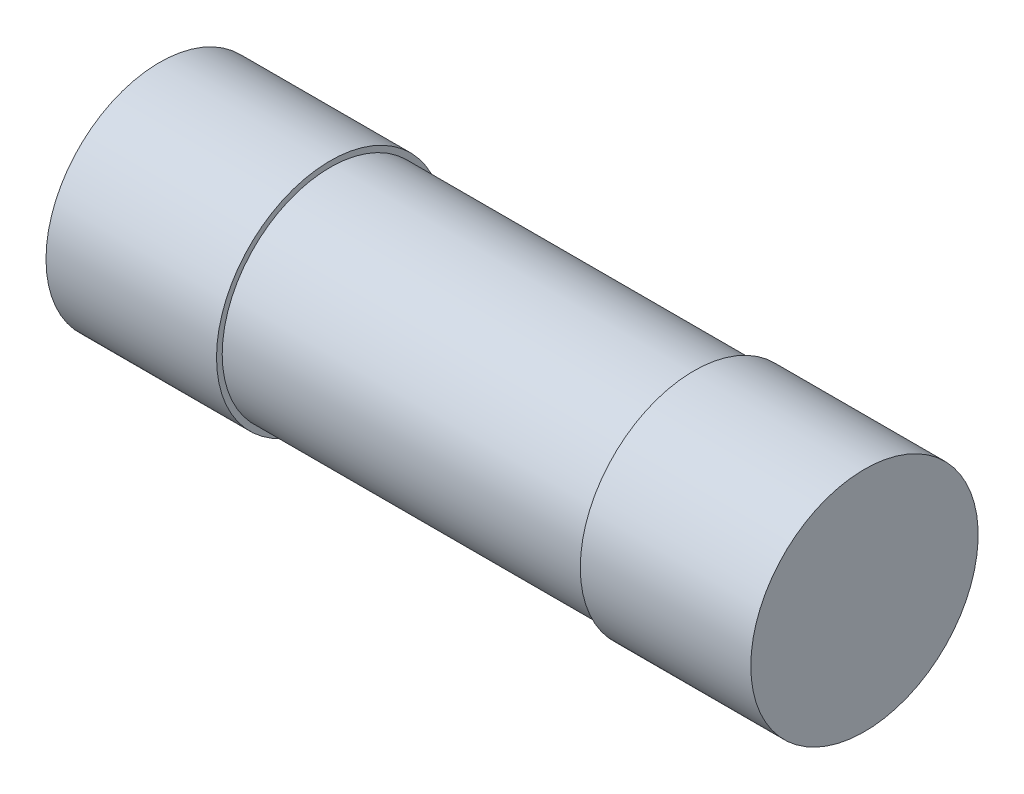
ISO-10303-21;
HEADER;
FILE_DESCRIPTION(('STEP AP214'),'2;1');
FILE_NAME('part.step','',(''),(''),'','','');
FILE_SCHEMA(('AUTOMOTIVE_DESIGN { 1 0 10303 214 1 1 1 1 }'));
ENDSEC;
DATA;
#1=APPLICATION_CONTEXT('core data for automotive mechanical design processes');
#2=APPLICATION_PROTOCOL_DEFINITION('international standard','automotive_design',2000,#1);
#3=PRODUCT_CONTEXT('',#1,'mechanical');
#4=PRODUCT('Part','Part','',(#3));
#5=PRODUCT_RELATED_PRODUCT_CATEGORY('part','',(#4));
#6=PRODUCT_DEFINITION_FORMATION('','',#4);
#7=PRODUCT_DEFINITION_CONTEXT('part definition',#1,'design');
#8=PRODUCT_DEFINITION('design','',#6,#7);
#9=PRODUCT_DEFINITION_SHAPE('','',#8);
#10=(LENGTH_UNIT() NAMED_UNIT(*) SI_UNIT(.MILLI.,.METRE.));
#11=(NAMED_UNIT(*) PLANE_ANGLE_UNIT() SI_UNIT($,.RADIAN.));
#12=(NAMED_UNIT(*) SI_UNIT($,.STERADIAN.) SOLID_ANGLE_UNIT());
#13=UNCERTAINTY_MEASURE_WITH_UNIT(LENGTH_MEASURE(1.E-05),#10,'distance_accuracy_value','');
#14=(GEOMETRIC_REPRESENTATION_CONTEXT(3) GLOBAL_UNCERTAINTY_ASSIGNED_CONTEXT((#13)) GLOBAL_UNIT_ASSIGNED_CONTEXT((#10,
#11,#12)) REPRESENTATION_CONTEXT('',''));
#15=CARTESIAN_POINT('',(0.,0.,0.));
#16=DIRECTION('',(0.,0.,1.));
#17=DIRECTION('',(1.,0.,0.));
#18=AXIS2_PLACEMENT_3D('',#15,#16,#17);
#19=CARTESIAN_POINT('',(0.,0.,0.));
#20=DIRECTION('',(1.,0.,0.));
#21=DIRECTION('',(0.,0.,-1.));
#22=AXIS2_PLACEMENT_3D('',#19,#20,#21);
#23=PLANE('',#22);
#24=CARTESIAN_POINT('',(0.,0.,0.));
#25=DIRECTION('',(-1.,0.,0.));
#26=DIRECTION('',(0.,0.,1.));
#27=AXIS2_PLACEMENT_3D('',#24,#25,#26);
#28=CIRCLE('',#27,9.99999999999999);
#29=CARTESIAN_POINT('',(0.,0.,9.99999999999999));
#30=VERTEX_POINT('',#29);
#31=EDGE_CURVE('E10',#30,#30,#28,.T.);
#32=ORIENTED_EDGE('',*,*,#31,.T.);
#33=EDGE_LOOP('',(#32));
#34=FACE_BOUND('',#33,.T.);
#35=ADVANCED_FACE('F34',(#34),#23,.F.);
#36=CARTESIAN_POINT('',(-40.4651162790698,0.,0.));
#37=DIRECTION('',(-1.,0.,0.));
#38=DIRECTION('',(0.,0.,1.));
#39=AXIS2_PLACEMENT_3D('',#36,#37,#38);
#40=CYLINDRICAL_SURFACE('',#39,9.99999999999999);
#41=ORIENTED_EDGE('',*,*,#31,.F.);
#42=EDGE_LOOP('',(#41));
#43=FACE_BOUND('',#42,.T.);
#44=CARTESIAN_POINT('',(15.,0.,0.));
#45=DIRECTION('',(-1.,0.,0.));
#46=DIRECTION('',(0.,0.,1.));
#47=AXIS2_PLACEMENT_3D('',#44,#45,#46);
#48=CIRCLE('',#47,9.99999999999999);
#49=CARTESIAN_POINT('',(15.,0.,9.99999999999999));
#50=VERTEX_POINT('',#49);
#51=EDGE_CURVE('E40',#50,#50,#48,.T.);
#52=ORIENTED_EDGE('',*,*,#51,.T.);
#53=EDGE_LOOP('',(#52));
#54=FACE_BOUND('',#53,.T.);
#55=ADVANCED_FACE('F72',(#43,#54),#40,.T.);
#56=CARTESIAN_POINT('',(15.,9.49999999999998,0.));
#57=DIRECTION('',(-1.,0.,0.));
#58=DIRECTION('',(0.,0.,1.));
#59=AXIS2_PLACEMENT_3D('',#56,#57,#58);
#60=PLANE('',#59);
#61=ORIENTED_EDGE('',*,*,#51,.F.);
#62=EDGE_LOOP('',(#61));
#63=FACE_BOUND('',#62,.T.);
#64=CARTESIAN_POINT('',(15.,0.,0.));
#65=DIRECTION('',(-1.,0.,0.));
#66=DIRECTION('',(0.,0.,1.));
#67=AXIS2_PLACEMENT_3D('',#64,#65,#66);
#68=CIRCLE('',#67,9.49999999999998);
#69=CARTESIAN_POINT('',(15.,0.,9.49999999999998));
#70=VERTEX_POINT('',#69);
#71=EDGE_CURVE('E44',#70,#70,#68,.T.);
#72=ORIENTED_EDGE('',*,*,#71,.T.);
#73=EDGE_LOOP('',(#72));
#74=FACE_BOUND('',#73,.T.);
#75=ADVANCED_FACE('F76',(#63,#74),#60,.F.);
#76=CARTESIAN_POINT('',(-40.4651162790698,0.,0.));
#77=DIRECTION('',(-1.,0.,0.));
#78=DIRECTION('',(0.,0.,1.));
#79=AXIS2_PLACEMENT_3D('',#76,#77,#78);
#80=CYLINDRICAL_SURFACE('',#79,9.49999999999998);
#81=ORIENTED_EDGE('',*,*,#71,.F.);
#82=EDGE_LOOP('',(#81));
#83=FACE_BOUND('',#82,.T.);
#84=CARTESIAN_POINT('',(47.,0.,0.));
#85=DIRECTION('',(-1.,0.,0.));
#86=DIRECTION('',(0.,0.,1.));
#87=AXIS2_PLACEMENT_3D('',#84,#85,#86);
#88=CIRCLE('',#87,9.49999999999998);
#89=CARTESIAN_POINT('',(47.,0.,9.49999999999998));
#90=VERTEX_POINT('',#89);
#91=EDGE_CURVE('E48',#90,#90,#88,.T.);
#92=ORIENTED_EDGE('',*,*,#91,.T.);
#93=EDGE_LOOP('',(#92));
#94=FACE_BOUND('',#93,.T.);
#95=ADVANCED_FACE('F81',(#83,#94),#80,.T.);
#96=CARTESIAN_POINT('',(47.,9.49999999999998,0.));
#97=DIRECTION('',(1.,0.,0.));
#98=DIRECTION('',(0.,0.,-1.));
#99=AXIS2_PLACEMENT_3D('',#96,#97,#98);
#100=PLANE('',#99);
#101=ORIENTED_EDGE('',*,*,#91,.F.);
#102=EDGE_LOOP('',(#101));
#103=FACE_BOUND('',#102,.T.);
#104=CARTESIAN_POINT('',(47.,0.,0.));
#105=DIRECTION('',(-1.,0.,0.));
#106=DIRECTION('',(0.,0.,1.));
#107=AXIS2_PLACEMENT_3D('',#104,#105,#106);
#108=CIRCLE('',#107,9.99999999999999);
#109=CARTESIAN_POINT('',(47.,0.,9.99999999999999));
#110=VERTEX_POINT('',#109);
#111=EDGE_CURVE('E53',#110,#110,#108,.T.);
#112=ORIENTED_EDGE('',*,*,#111,.T.);
#113=EDGE_LOOP('',(#112));
#114=FACE_BOUND('',#113,.T.);
#115=ADVANCED_FACE('F68',(#103,#114),#100,.F.);
#116=CARTESIAN_POINT('',(-40.4651162790698,0.,0.));
#117=DIRECTION('',(-1.,0.,0.));
#118=DIRECTION('',(0.,0.,1.));
#119=AXIS2_PLACEMENT_3D('',#116,#117,#118);
#120=CYLINDRICAL_SURFACE('',#119,9.99999999999999);
#121=ORIENTED_EDGE('',*,*,#111,.F.);
#122=EDGE_LOOP('',(#121));
#123=FACE_BOUND('',#122,.T.);
#124=CARTESIAN_POINT('',(62.,0.,0.));
#125=DIRECTION('',(-1.,0.,0.));
#126=DIRECTION('',(0.,0.,1.));
#127=AXIS2_PLACEMENT_3D('',#124,#125,#126);
#128=CIRCLE('',#127,9.99999999999999);
#129=CARTESIAN_POINT('',(62.,0.,9.99999999999999));
#130=VERTEX_POINT('',#129);
#131=EDGE_CURVE('E56',#130,#130,#128,.T.);
#132=ORIENTED_EDGE('',*,*,#131,.T.);
#133=EDGE_LOOP('',(#132));
#134=FACE_BOUND('',#133,.T.);
#135=ADVANCED_FACE('F60',(#123,#134),#120,.T.);
#136=CARTESIAN_POINT('',(62.,9.99999999999999,0.));
#137=DIRECTION('',(-1.,0.,0.));
#138=DIRECTION('',(0.,0.,1.));
#139=AXIS2_PLACEMENT_3D('',#136,#137,#138);
#140=PLANE('',#139);
#141=ORIENTED_EDGE('',*,*,#131,.F.);
#142=EDGE_LOOP('',(#141));
#143=FACE_BOUND('',#142,.T.);
#144=ADVANCED_FACE('F62',(#143),#140,.F.);
#145=CLOSED_SHELL('',(#35,#55,#75,#95,#115,#135,#144));
#146=MANIFOLD_SOLID_BREP('B2',#145);
#147=ADVANCED_BREP_SHAPE_REPRESENTATION('',(#18,#146),#14);
#148=SHAPE_DEFINITION_REPRESENTATION(#9,#147);
ENDSEC;
END-ISO-10303-21;
